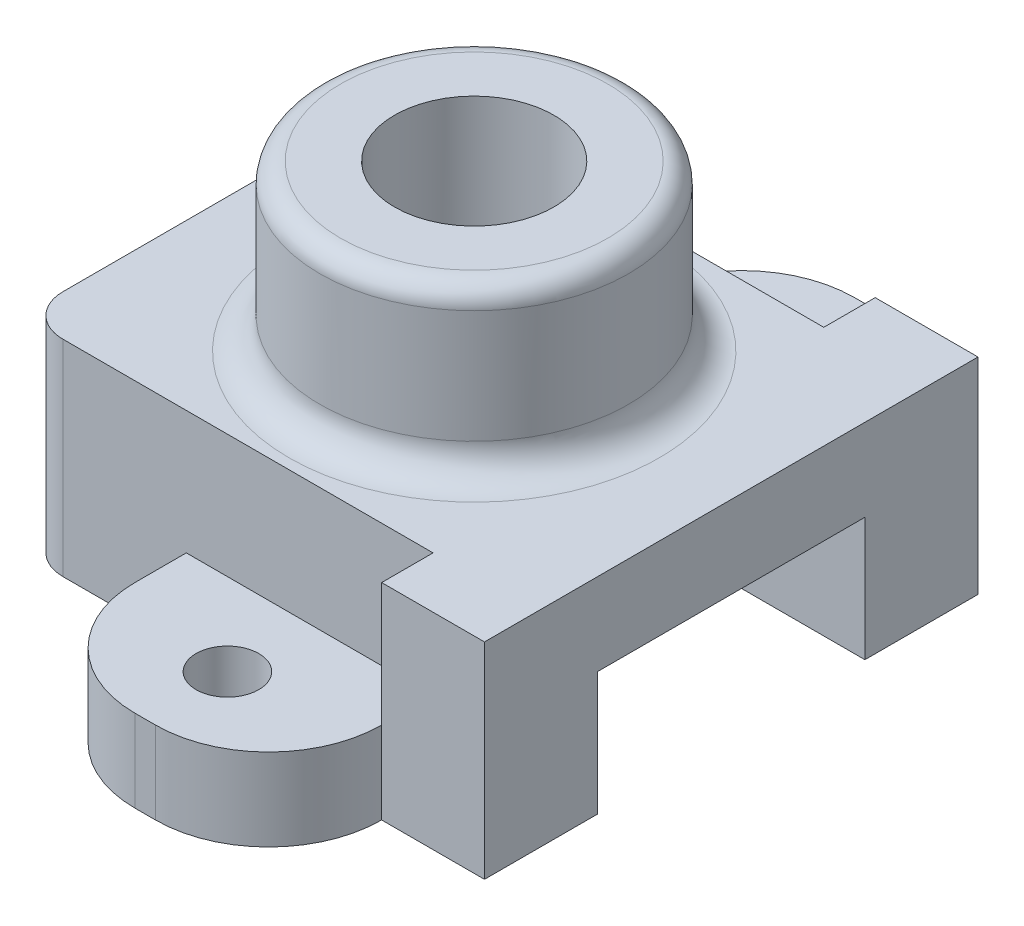
ISO-10303-21;
HEADER;
FILE_DESCRIPTION(('STEP AP214'),'2;1');
FILE_NAME('part.step','',(''),(''),'','','');
FILE_SCHEMA(('AUTOMOTIVE_DESIGN { 1 0 10303 214 1 1 1 1 }'));
ENDSEC;
DATA;
#1=APPLICATION_CONTEXT('core data for automotive mechanical design processes');
#2=APPLICATION_PROTOCOL_DEFINITION('international standard','automotive_design',2000,#1);
#3=PRODUCT_CONTEXT('',#1,'mechanical');
#4=PRODUCT('Part','Part','',(#3));
#5=PRODUCT_RELATED_PRODUCT_CATEGORY('part','',(#4));
#6=PRODUCT_DEFINITION_FORMATION('','',#4);
#7=PRODUCT_DEFINITION_CONTEXT('part definition',#1,'design');
#8=PRODUCT_DEFINITION('design','',#6,#7);
#9=PRODUCT_DEFINITION_SHAPE('','',#8);
#10=(LENGTH_UNIT() NAMED_UNIT(*) SI_UNIT(.MILLI.,.METRE.));
#11=(NAMED_UNIT(*) PLANE_ANGLE_UNIT() SI_UNIT($,.RADIAN.));
#12=(NAMED_UNIT(*) SI_UNIT($,.STERADIAN.) SOLID_ANGLE_UNIT());
#13=UNCERTAINTY_MEASURE_WITH_UNIT(LENGTH_MEASURE(1.E-05),#10,'distance_accuracy_value','');
#14=(GEOMETRIC_REPRESENTATION_CONTEXT(3) GLOBAL_UNCERTAINTY_ASSIGNED_CONTEXT((#13)) GLOBAL_UNIT_ASSIGNED_CONTEXT((#10,
#11,#12)) REPRESENTATION_CONTEXT('',''));
#15=CARTESIAN_POINT('',(0.,0.,0.));
#16=DIRECTION('',(0.,0.,1.));
#17=DIRECTION('',(1.,0.,0.));
#18=AXIS2_PLACEMENT_3D('',#15,#16,#17);
#19=CARTESIAN_POINT('',(-0.999999999999986,6.,-16.));
#20=DIRECTION('',(0.,0.,1.));
#21=DIRECTION('',(1.,0.,0.));
#22=AXIS2_PLACEMENT_3D('',#19,#20,#21);
#23=PLANE('',#22);
#24=DIRECTION('',(0.,-1.,0.));
#25=VECTOR('',#24,1.);
#26=CARTESIAN_POINT('',(-0.999999999999986,6.,-16.));
#27=LINE('',#26,#25);
#28=CARTESIAN_POINT('',(-0.999999999999987,10.,-16.));
#29=VERTEX_POINT('',#28);
#30=CARTESIAN_POINT('',(-0.999999999999986,0.,-16.));
#31=VERTEX_POINT('',#30);
#32=EDGE_CURVE('E449',#29,#31,#27,.T.);
#33=ORIENTED_EDGE('',*,*,#32,.F.);
#34=DIRECTION('',(-1.,0.,0.));
#35=VECTOR('',#34,1.);
#36=CARTESIAN_POINT('',(-0.999999999999987,10.,-16.));
#37=LINE('',#36,#35);
#38=CARTESIAN_POINT('',(17.,10.,-16.));
#39=VERTEX_POINT('',#38);
#40=EDGE_CURVE('E267',#39,#29,#37,.T.);
#41=ORIENTED_EDGE('',*,*,#40,.F.);
#42=DIRECTION('',(0.,1.,0.));
#43=VECTOR('',#42,1.);
#44=CARTESIAN_POINT('',(17.,-5.59016994374948,-16.));
#45=LINE('',#44,#43);
#46=CARTESIAN_POINT('',(17.,4.,-16.));
#47=VERTEX_POINT('',#46);
#48=EDGE_CURVE('E285',#47,#39,#45,.T.);
#49=ORIENTED_EDGE('',*,*,#48,.F.);
#50=DIRECTION('',(1.,0.,0.));
#51=VECTOR('',#50,1.);
#52=CARTESIAN_POINT('',(17.,4.,-16.));
#53=LINE('',#52,#51);
#54=CARTESIAN_POINT('',(5.,4.,-16.));
#55=VERTEX_POINT('',#54);
#56=EDGE_CURVE('E314',#55,#47,#53,.T.);
#57=ORIENTED_EDGE('',*,*,#56,.F.);
#58=DIRECTION('',(0.,-1.,0.));
#59=VECTOR('',#58,1.);
#60=CARTESIAN_POINT('',(5.,22.422205101856,-16.));
#61=LINE('',#60,#59);
#62=CARTESIAN_POINT('',(5.,0.,-16.));
#63=VERTEX_POINT('',#62);
#64=EDGE_CURVE('E362',#55,#63,#61,.T.);
#65=ORIENTED_EDGE('',*,*,#64,.T.);
#66=DIRECTION('',(-1.,0.,0.));
#67=VECTOR('',#66,1.);
#68=CARTESIAN_POINT('',(-0.999999999999986,0.,-16.));
#69=LINE('',#68,#67);
#70=EDGE_CURVE('E427',#63,#31,#69,.T.);
#71=ORIENTED_EDGE('',*,*,#70,.T.);
#72=EDGE_LOOP('',(#33,#41,#49,#57,#65,#71));
#73=FACE_BOUND('',#72,.T.);
#74=ADVANCED_FACE('F33',(#73),#23,.F.);
#75=CARTESIAN_POINT('',(5.,22.422205101856,3.));
#76=DIRECTION('',(-1.,0.,0.));
#77=DIRECTION('',(0.,0.,1.));
#78=AXIS2_PLACEMENT_3D('',#75,#76,#77);
#79=PLANE('',#78);
#80=DIRECTION('',(0.,-1.,0.));
#81=VECTOR('',#80,1.);
#82=CARTESIAN_POINT('',(5.,22.422205101856,5.5));
#83=LINE('',#82,#81);
#84=CARTESIAN_POINT('',(5.,4.,5.5));
#85=VERTEX_POINT('',#84);
#86=CARTESIAN_POINT('',(5.,0.,5.5));
#87=VERTEX_POINT('',#86);
#88=EDGE_CURVE('E386',#85,#87,#83,.T.);
#89=ORIENTED_EDGE('',*,*,#88,.F.);
#90=DIRECTION('',(0.,0.,-1.));
#91=VECTOR('',#90,1.);
#92=CARTESIAN_POINT('',(5.,4.,3.));
#93=LINE('',#92,#91);
#94=CARTESIAN_POINT('',(5.,4.,3.));
#95=VERTEX_POINT('',#94);
#96=EDGE_CURVE('E306',#85,#95,#93,.T.);
#97=ORIENTED_EDGE('',*,*,#96,.T.);
#98=DIRECTION('',(0.,-1.,0.));
#99=VECTOR('',#98,1.);
#100=CARTESIAN_POINT('',(5.,22.422205101856,3.));
#101=LINE('',#100,#99);
#102=CARTESIAN_POINT('',(5.,0.,3.));
#103=VERTEX_POINT('',#102);
#104=EDGE_CURVE('E385',#95,#103,#101,.T.);
#105=ORIENTED_EDGE('',*,*,#104,.T.);
#106=DIRECTION('',(0.,0.,-1.));
#107=VECTOR('',#106,1.);
#108=CARTESIAN_POINT('',(5.,0.,3.));
#109=LINE('',#108,#107);
#110=EDGE_CURVE('E366',#87,#103,#109,.T.);
#111=ORIENTED_EDGE('',*,*,#110,.F.);
#112=EDGE_LOOP('',(#89,#97,#105,#111));
#113=FACE_BOUND('',#112,.T.);
#114=ADVANCED_FACE('F494',(#113),#79,.T.);
#115=CARTESIAN_POINT('',(10.5,22.422205101856,5.5));
#116=DIRECTION('',(0.,-1.,0.));
#117=DIRECTION('',(0.,0.,-1.));
#118=AXIS2_PLACEMENT_3D('',#115,#116,#117);
#119=CYLINDRICAL_SURFACE('',#118,5.5);
#120=DIRECTION('',(0.,-1.,0.));
#121=VECTOR('',#120,1.);
#122=CARTESIAN_POINT('',(10.5,22.422205101856,11.));
#123=LINE('',#122,#121);
#124=CARTESIAN_POINT('',(10.5,4.,11.));
#125=VERTEX_POINT('',#124);
#126=CARTESIAN_POINT('',(10.5,0.,11.));
#127=VERTEX_POINT('',#126);
#128=EDGE_CURVE('E389',#125,#127,#123,.T.);
#129=ORIENTED_EDGE('',*,*,#128,.F.);
#130=CARTESIAN_POINT('',(10.5,4.,5.5));
#131=DIRECTION('',(0.,1.,0.));
#132=DIRECTION('',(0.,0.,1.));
#133=AXIS2_PLACEMENT_3D('',#130,#131,#132);
#134=CIRCLE('',#133,5.5);
#135=EDGE_CURVE('E303',#125,#85,#134,.F.);
#136=ORIENTED_EDGE('',*,*,#135,.T.);
#137=ORIENTED_EDGE('',*,*,#88,.T.);
#138=CARTESIAN_POINT('',(10.5,0.,5.5));
#139=DIRECTION('',(0.,-1.,0.));
#140=DIRECTION('',(0.,0.,1.));
#141=AXIS2_PLACEMENT_3D('',#138,#139,#140);
#142=CIRCLE('',#141,5.5);
#143=EDGE_CURVE('E382',#127,#87,#142,.T.);
#144=ORIENTED_EDGE('',*,*,#143,.F.);
#145=EDGE_LOOP('',(#129,#136,#137,#144));
#146=FACE_BOUND('',#145,.T.);
#147=ADVANCED_FACE('F502',(#146),#119,.T.);
#148=CARTESIAN_POINT('',(10.5,22.422205101856,11.));
#149=DIRECTION('',(0.,0.,1.));
#150=DIRECTION('',(1.,0.,0.));
#151=AXIS2_PLACEMENT_3D('',#148,#149,#150);
#152=PLANE('',#151);
#153=DIRECTION('',(0.,-1.,0.));
#154=VECTOR('',#153,1.);
#155=CARTESIAN_POINT('',(11.5,22.422205101856,11.));
#156=LINE('',#155,#154);
#157=CARTESIAN_POINT('',(11.5,4.,11.));
#158=VERTEX_POINT('',#157);
#159=CARTESIAN_POINT('',(11.5,0.,11.));
#160=VERTEX_POINT('',#159);
#161=EDGE_CURVE('E391',#158,#160,#156,.T.);
#162=ORIENTED_EDGE('',*,*,#161,.F.);
#163=DIRECTION('',(-1.,0.,0.));
#164=VECTOR('',#163,1.);
#165=CARTESIAN_POINT('',(10.5,4.,11.));
#166=LINE('',#165,#164);
#167=EDGE_CURVE('E300',#158,#125,#166,.T.);
#168=ORIENTED_EDGE('',*,*,#167,.T.);
#169=ORIENTED_EDGE('',*,*,#128,.T.);
#170=DIRECTION('',(-1.,0.,0.));
#171=VECTOR('',#170,1.);
#172=CARTESIAN_POINT('',(10.5,0.,11.));
#173=LINE('',#172,#171);
#174=EDGE_CURVE('E379',#160,#127,#173,.T.);
#175=ORIENTED_EDGE('',*,*,#174,.F.);
#176=EDGE_LOOP('',(#162,#168,#169,#175));
#177=FACE_BOUND('',#176,.T.);
#178=ADVANCED_FACE('F646',(#177),#152,.T.);
#179=CARTESIAN_POINT('',(11.5,22.422205101856,5.5));
#180=DIRECTION('',(0.,-1.,0.));
#181=DIRECTION('',(0.,0.,-1.));
#182=AXIS2_PLACEMENT_3D('',#179,#180,#181);
#183=CYLINDRICAL_SURFACE('',#182,5.5);
#184=DIRECTION('',(0.,-1.,0.));
#185=VECTOR('',#184,1.);
#186=CARTESIAN_POINT('',(17.,22.422205101856,5.5));
#187=LINE('',#186,#185);
#188=CARTESIAN_POINT('',(17.,4.,5.5));
#189=VERTEX_POINT('',#188);
#190=CARTESIAN_POINT('',(17.,0.,5.5));
#191=VERTEX_POINT('',#190);
#192=EDGE_CURVE('E393',#189,#191,#187,.T.);
#193=ORIENTED_EDGE('',*,*,#192,.F.);
#194=CARTESIAN_POINT('',(11.5,4.,5.5));
#195=DIRECTION('',(0.,1.,0.));
#196=DIRECTION('',(0.,0.,1.));
#197=AXIS2_PLACEMENT_3D('',#194,#195,#196);
#198=CIRCLE('',#197,5.5);
#199=EDGE_CURVE('E297',#189,#158,#198,.F.);
#200=ORIENTED_EDGE('',*,*,#199,.T.);
#201=ORIENTED_EDGE('',*,*,#161,.T.);
#202=CARTESIAN_POINT('',(11.5,0.,5.5));
#203=DIRECTION('',(0.,-1.,0.));
#204=DIRECTION('',(0.,0.,1.));
#205=AXIS2_PLACEMENT_3D('',#202,#203,#204);
#206=CIRCLE('',#205,5.5);
#207=EDGE_CURVE('E376',#191,#160,#206,.T.);
#208=ORIENTED_EDGE('',*,*,#207,.F.);
#209=EDGE_LOOP('',(#193,#200,#201,#208));
#210=FACE_BOUND('',#209,.T.);
#211=ADVANCED_FACE('F559',(#210),#183,.T.);
#212=CARTESIAN_POINT('',(11.,8.,7.));
#213=DIRECTION('',(0.,-1.,0.));
#214=DIRECTION('',(0.,0.,-1.));
#215=AXIS2_PLACEMENT_3D('',#212,#213,#214);
#216=CYLINDRICAL_SURFACE('',#215,1.524);
#217=CARTESIAN_POINT('',(11.,0.,7.));
#218=DIRECTION('',(0.,-1.,0.));
#219=DIRECTION('',(0.,0.,-1.));
#220=AXIS2_PLACEMENT_3D('',#217,#218,#219);
#221=CIRCLE('',#220,1.524);
#222=CARTESIAN_POINT('',(11.,0.,5.476));
#223=VERTEX_POINT('',#222);
#224=EDGE_CURVE('E344',#223,#223,#221,.T.);
#225=ORIENTED_EDGE('',*,*,#224,.T.);
#226=EDGE_LOOP('',(#225));
#227=FACE_BOUND('',#226,.T.);
#228=CARTESIAN_POINT('',(11.,4.,7.));
#229=DIRECTION('',(0.,1.,0.));
#230=DIRECTION('',(0.,0.,1.));
#231=AXIS2_PLACEMENT_3D('',#228,#229,#230);
#232=CIRCLE('',#231,1.524);
#233=CARTESIAN_POINT('',(11.,4.,8.524));
#234=VERTEX_POINT('',#233);
#235=EDGE_CURVE('E295',#234,#234,#232,.F.);
#236=ORIENTED_EDGE('',*,*,#235,.F.);
#237=EDGE_LOOP('',(#236));
#238=FACE_BOUND('',#237,.T.);
#239=ADVANCED_FACE('F624',(#227,#238),#216,.F.);
#240=CARTESIAN_POINT('',(11.5,22.422205101856,-18.5));
#241=DIRECTION('',(0.,-1.,0.));
#242=DIRECTION('',(0.,0.,-1.));
#243=AXIS2_PLACEMENT_3D('',#240,#241,#242);
#244=CYLINDRICAL_SURFACE('',#243,5.5);
#245=DIRECTION('',(0.,-1.,0.));
#246=VECTOR('',#245,1.);
#247=CARTESIAN_POINT('',(11.5,22.422205101856,-24.));
#248=LINE('',#247,#246);
#249=CARTESIAN_POINT('',(11.5,4.,-24.));
#250=VERTEX_POINT('',#249);
#251=CARTESIAN_POINT('',(11.5,0.,-24.));
#252=VERTEX_POINT('',#251);
#253=EDGE_CURVE('E367',#250,#252,#248,.T.);
#254=ORIENTED_EDGE('',*,*,#253,.F.);
#255=CARTESIAN_POINT('',(11.5,4.,-18.5));
#256=DIRECTION('',(0.,1.,0.));
#257=DIRECTION('',(0.,0.,1.));
#258=AXIS2_PLACEMENT_3D('',#255,#256,#257);
#259=CIRCLE('',#258,5.5);
#260=CARTESIAN_POINT('',(17.,4.,-18.5));
#261=VERTEX_POINT('',#260);
#262=EDGE_CURVE('E322',#250,#261,#259,.F.);
#263=ORIENTED_EDGE('',*,*,#262,.T.);
#264=DIRECTION('',(0.,-1.,0.));
#265=VECTOR('',#264,1.);
#266=CARTESIAN_POINT('',(17.,22.422205101856,-18.5));
#267=LINE('',#266,#265);
#268=CARTESIAN_POINT('',(17.,0.,-18.5));
#269=VERTEX_POINT('',#268);
#270=EDGE_CURVE('E363',#261,#269,#267,.T.);
#271=ORIENTED_EDGE('',*,*,#270,.T.);
#272=CARTESIAN_POINT('',(11.5,0.,-18.5));
#273=DIRECTION('',(0.,-1.,0.));
#274=DIRECTION('',(0.,0.,1.));
#275=AXIS2_PLACEMENT_3D('',#272,#273,#274);
#276=CIRCLE('',#275,5.5);
#277=EDGE_CURVE('E359',#252,#269,#276,.T.);
#278=ORIENTED_EDGE('',*,*,#277,.F.);
#279=EDGE_LOOP('',(#254,#263,#271,#278));
#280=FACE_BOUND('',#279,.T.);
#281=ADVANCED_FACE('F627',(#280),#244,.T.);
#282=CARTESIAN_POINT('',(11.5,22.422205101856,-24.));
#283=DIRECTION('',(0.,0.,-1.));
#284=DIRECTION('',(-1.,0.,0.));
#285=AXIS2_PLACEMENT_3D('',#282,#283,#284);
#286=PLANE('',#285);
#287=DIRECTION('',(0.,-1.,0.));
#288=VECTOR('',#287,1.);
#289=CARTESIAN_POINT('',(10.5,22.422205101856,-24.));
#290=LINE('',#289,#288);
#291=CARTESIAN_POINT('',(10.5,4.,-24.));
#292=VERTEX_POINT('',#291);
#293=CARTESIAN_POINT('',(10.5,0.,-24.));
#294=VERTEX_POINT('',#293);
#295=EDGE_CURVE('E369',#292,#294,#290,.T.);
#296=ORIENTED_EDGE('',*,*,#295,.F.);
#297=DIRECTION('',(1.,0.,0.));
#298=VECTOR('',#297,1.);
#299=CARTESIAN_POINT('',(11.5,4.,-24.));
#300=LINE('',#299,#298);
#301=EDGE_CURVE('E319',#292,#250,#300,.T.);
#302=ORIENTED_EDGE('',*,*,#301,.T.);
#303=ORIENTED_EDGE('',*,*,#253,.T.);
#304=DIRECTION('',(1.,0.,0.));
#305=VECTOR('',#304,1.);
#306=CARTESIAN_POINT('',(11.5,0.,-24.));
#307=LINE('',#306,#305);
#308=EDGE_CURVE('E356',#294,#252,#307,.T.);
#309=ORIENTED_EDGE('',*,*,#308,.F.);
#310=EDGE_LOOP('',(#296,#302,#303,#309));
#311=FACE_BOUND('',#310,.T.);
#312=ADVANCED_FACE('F635',(#311),#286,.T.);
#313=CARTESIAN_POINT('',(10.5,22.422205101856,-18.5));
#314=DIRECTION('',(0.,-1.,0.));
#315=DIRECTION('',(0.,0.,-1.));
#316=AXIS2_PLACEMENT_3D('',#313,#314,#315);
#317=CYLINDRICAL_SURFACE('',#316,5.5);
#318=DIRECTION('',(0.,-1.,0.));
#319=VECTOR('',#318,1.);
#320=CARTESIAN_POINT('',(5.,22.422205101856,-18.5));
#321=LINE('',#320,#319);
#322=CARTESIAN_POINT('',(5.,4.,-18.5));
#323=VERTEX_POINT('',#322);
#324=CARTESIAN_POINT('',(5.,0.,-18.5));
#325=VERTEX_POINT('',#324);
#326=EDGE_CURVE('E371',#323,#325,#321,.T.);
#327=ORIENTED_EDGE('',*,*,#326,.F.);
#328=CARTESIAN_POINT('',(10.5,4.,-18.5));
#329=DIRECTION('',(0.,1.,0.));
#330=DIRECTION('',(0.,0.,1.));
#331=AXIS2_PLACEMENT_3D('',#328,#329,#330);
#332=CIRCLE('',#331,5.5);
#333=EDGE_CURVE('E48',#323,#292,#332,.F.);
#334=ORIENTED_EDGE('',*,*,#333,.T.);
#335=ORIENTED_EDGE('',*,*,#295,.T.);
#336=CARTESIAN_POINT('',(10.5,0.,-18.5));
#337=DIRECTION('',(0.,-1.,0.));
#338=DIRECTION('',(0.,0.,1.));
#339=AXIS2_PLACEMENT_3D('',#336,#337,#338);
#340=CIRCLE('',#339,5.5);
#341=EDGE_CURVE('E353',#325,#294,#340,.T.);
#342=ORIENTED_EDGE('',*,*,#341,.F.);
#343=EDGE_LOOP('',(#327,#334,#335,#342));
#344=FACE_BOUND('',#343,.T.);
#345=ADVANCED_FACE('F604',(#344),#317,.T.);
#346=CARTESIAN_POINT('',(5.,22.422205101856,-16.));
#347=DIRECTION('',(-1.,0.,0.));
#348=DIRECTION('',(0.,0.,1.));
#349=AXIS2_PLACEMENT_3D('',#346,#347,#348);
#350=PLANE('',#349);
#351=ORIENTED_EDGE('',*,*,#64,.F.);
#352=DIRECTION('',(0.,0.,1.));
#353=VECTOR('',#352,1.);
#354=CARTESIAN_POINT('',(5.,4.,-16.));
#355=LINE('',#354,#353);
#356=EDGE_CURVE('E312',#323,#55,#355,.T.);
#357=ORIENTED_EDGE('',*,*,#356,.F.);
#358=ORIENTED_EDGE('',*,*,#326,.T.);
#359=DIRECTION('',(0.,0.,-1.));
#360=VECTOR('',#359,1.);
#361=CARTESIAN_POINT('',(5.,0.,-16.));
#362=LINE('',#361,#360);
#363=EDGE_CURVE('E350',#63,#325,#362,.T.);
#364=ORIENTED_EDGE('',*,*,#363,.F.);
#365=EDGE_LOOP('',(#351,#357,#358,#364));
#366=FACE_BOUND('',#365,.T.);
#367=ADVANCED_FACE('F600',(#366),#350,.T.);
#368=CARTESIAN_POINT('',(11.,8.,-20.));
#369=DIRECTION('',(0.,-1.,0.));
#370=DIRECTION('',(0.,0.,-1.));
#371=AXIS2_PLACEMENT_3D('',#368,#369,#370);
#372=CYLINDRICAL_SURFACE('',#371,1.525);
#373=CARTESIAN_POINT('',(11.,0.,-20.));
#374=DIRECTION('',(0.,-1.,0.));
#375=DIRECTION('',(0.,0.,-1.));
#376=AXIS2_PLACEMENT_3D('',#373,#374,#375);
#377=CIRCLE('',#376,1.525);
#378=CARTESIAN_POINT('',(11.,0.,-21.525));
#379=VERTEX_POINT('',#378);
#380=EDGE_CURVE('E347',#379,#379,#377,.T.);
#381=ORIENTED_EDGE('',*,*,#380,.T.);
#382=EDGE_LOOP('',(#381));
#383=FACE_BOUND('',#382,.T.);
#384=CARTESIAN_POINT('',(11.,4.,-20.));
#385=DIRECTION('',(0.,1.,0.));
#386=DIRECTION('',(0.,0.,1.));
#387=AXIS2_PLACEMENT_3D('',#384,#385,#386);
#388=CIRCLE('',#387,1.525);
#389=CARTESIAN_POINT('',(11.,4.,-18.475));
#390=VERTEX_POINT('',#389);
#391=EDGE_CURVE('E317',#390,#390,#388,.F.);
#392=ORIENTED_EDGE('',*,*,#391,.F.);
#393=EDGE_LOOP('',(#392));
#394=FACE_BOUND('',#393,.T.);
#395=ADVANCED_FACE('F629',(#383,#394),#372,.F.);
#396=CARTESIAN_POINT('',(-1.,0.,1.));
#397=DIRECTION('',(0.,-1.,0.));
#398=DIRECTION('',(0.,0.,-1.));
#399=AXIS2_PLACEMENT_3D('',#396,#397,#398);
#400=PLANE('',#399);
#401=DIRECTION('',(-1.,0.,0.));
#402=VECTOR('',#401,1.);
#403=CARTESIAN_POINT('',(17.,0.,-18.5));
#404=LINE('',#403,#402);
#405=CARTESIAN_POINT('',(22.,0.,-18.5));
#406=VERTEX_POINT('',#405);
#407=EDGE_CURVE('E235',#406,#269,#404,.T.);
#408=ORIENTED_EDGE('',*,*,#407,.F.);
#409=DIRECTION('',(0.,0.,-1.));
#410=VECTOR('',#409,1.);
#411=CARTESIAN_POINT('',(22.,0.,-18.5));
#412=LINE('',#411,#410);
#413=CARTESIAN_POINT('',(22.,0.,-13.));
#414=VERTEX_POINT('',#413);
#415=EDGE_CURVE('E287',#414,#406,#412,.T.);
#416=ORIENTED_EDGE('',*,*,#415,.F.);
#417=DIRECTION('',(-1.,0.,0.));
#418=VECTOR('',#417,1.);
#419=CARTESIAN_POINT('',(0.,0.,-13.));
#420=LINE('',#419,#418);
#421=CARTESIAN_POINT('',(0.,0.,-13.));
#422=VERTEX_POINT('',#421);
#423=EDGE_CURVE('E400',#414,#422,#420,.T.);
#424=ORIENTED_EDGE('',*,*,#423,.T.);
#425=DIRECTION('',(0.,0.,1.));
#426=VECTOR('',#425,1.);
#427=CARTESIAN_POINT('',(0.,0.,0.));
#428=LINE('',#427,#426);
#429=CARTESIAN_POINT('',(0.,0.,-11.));
#430=VERTEX_POINT('',#429);
#431=EDGE_CURVE('E409',#422,#430,#428,.T.);
#432=ORIENTED_EDGE('',*,*,#431,.T.);
#433=DIRECTION('',(1.,0.,0.));
#434=VECTOR('',#433,1.);
#435=CARTESIAN_POINT('',(-3.,0.,-11.));
#436=LINE('',#435,#434);
#437=CARTESIAN_POINT('',(-3.,0.,-11.));
#438=VERTEX_POINT('',#437);
#439=EDGE_CURVE('E333',#438,#430,#436,.T.);
#440=ORIENTED_EDGE('',*,*,#439,.F.);
#441=DIRECTION('',(0.,0.,1.));
#442=VECTOR('',#441,1.);
#443=CARTESIAN_POINT('',(-3.,0.,0.999999999999986));
#444=LINE('',#443,#442);
#445=CARTESIAN_POINT('',(-3.,0.,-14.));
#446=VERTEX_POINT('',#445);
#447=EDGE_CURVE('E432',#446,#438,#444,.T.);
#448=ORIENTED_EDGE('',*,*,#447,.F.);
#449=CARTESIAN_POINT('',(-1.,0.,-14.));
#450=DIRECTION('',(0.,1.,0.));
#451=DIRECTION('',(0.,0.,1.));
#452=AXIS2_PLACEMENT_3D('',#449,#450,#451);
#453=CIRCLE('',#452,2.);
#454=EDGE_CURVE('E429',#31,#446,#453,.T.);
#455=ORIENTED_EDGE('',*,*,#454,.F.);
#456=ORIENTED_EDGE('',*,*,#70,.F.);
#457=ORIENTED_EDGE('',*,*,#363,.T.);
#458=ORIENTED_EDGE('',*,*,#341,.T.);
#459=ORIENTED_EDGE('',*,*,#308,.T.);
#460=ORIENTED_EDGE('',*,*,#277,.T.);
#461=EDGE_LOOP('',(#408,#416,#424,#432,#440,#448,#455,#456,#457,#458,#459,#460));
#462=FACE_BOUND('',#461,.T.);
#463=ORIENTED_EDGE('',*,*,#380,.F.);
#464=EDGE_LOOP('',(#463));
#465=FACE_BOUND('',#464,.T.);
#466=ADVANCED_FACE('F582',(#462,#465),#400,.T.);
#467=DIRECTION('',(1.,0.,0.));
#468=VECTOR('',#467,1.);
#469=CARTESIAN_POINT('',(0.,0.,0.));
#470=LINE('',#469,#468);
#471=CARTESIAN_POINT('',(0.,0.,0.));
#472=VERTEX_POINT('',#471);
#473=CARTESIAN_POINT('',(22.,0.,0.));
#474=VERTEX_POINT('',#473);
#475=EDGE_CURVE('E412',#472,#474,#470,.T.);
#476=ORIENTED_EDGE('',*,*,#475,.T.);
#477=CARTESIAN_POINT('',(22.,0.,5.5));
#478=VERTEX_POINT('',#477);
#479=EDGE_CURVE('E288',#478,#474,#412,.T.);
#480=ORIENTED_EDGE('',*,*,#479,.F.);
#481=DIRECTION('',(1.,0.,0.));
#482=VECTOR('',#481,1.);
#483=CARTESIAN_POINT('',(17.,0.,5.5));
#484=LINE('',#483,#482);
#485=EDGE_CURVE('E279',#191,#478,#484,.T.);
#486=ORIENTED_EDGE('',*,*,#485,.F.);
#487=ORIENTED_EDGE('',*,*,#207,.T.);
#488=ORIENTED_EDGE('',*,*,#174,.T.);
#489=ORIENTED_EDGE('',*,*,#143,.T.);
#490=ORIENTED_EDGE('',*,*,#110,.T.);
#491=DIRECTION('',(1.,0.,0.));
#492=VECTOR('',#491,1.);
#493=CARTESIAN_POINT('',(-0.999999999999987,0.,3.));
#494=LINE('',#493,#492);
#495=CARTESIAN_POINT('',(-0.999999999999987,0.,3.));
#496=VERTEX_POINT('',#495);
#497=EDGE_CURVE('E437',#496,#103,#494,.T.);
#498=ORIENTED_EDGE('',*,*,#497,.F.);
#499=CARTESIAN_POINT('',(-1.,0.,1.));
#500=DIRECTION('',(0.,1.,0.));
#501=DIRECTION('',(0.,0.,-1.));
#502=AXIS2_PLACEMENT_3D('',#499,#500,#501);
#503=CIRCLE('',#502,2.);
#504=CARTESIAN_POINT('',(-3.,0.,0.999999999999987));
#505=VERTEX_POINT('',#504);
#506=EDGE_CURVE('E435',#505,#496,#503,.T.);
#507=ORIENTED_EDGE('',*,*,#506,.F.);
#508=CARTESIAN_POINT('',(-3.,0.,-2.));
#509=VERTEX_POINT('',#508);
#510=EDGE_CURVE('E431',#509,#505,#444,.T.);
#511=ORIENTED_EDGE('',*,*,#510,.F.);
#512=DIRECTION('',(1.,0.,0.));
#513=VECTOR('',#512,1.);
#514=CARTESIAN_POINT('',(-3.,0.,-2.));
#515=LINE('',#514,#513);
#516=CARTESIAN_POINT('',(0.,0.,-2.));
#517=VERTEX_POINT('',#516);
#518=EDGE_CURVE('E332',#509,#517,#515,.T.);
#519=ORIENTED_EDGE('',*,*,#518,.T.);
#520=EDGE_CURVE('E388',#517,#472,#428,.T.);
#521=ORIENTED_EDGE('',*,*,#520,.T.);
#522=EDGE_LOOP('',(#476,#480,#486,#487,#488,#489,#490,#498,#507,#511,#519,#521));
#523=FACE_BOUND('',#522,.T.);
#524=ORIENTED_EDGE('',*,*,#224,.F.);
#525=EDGE_LOOP('',(#524));
#526=FACE_BOUND('',#525,.T.);
#527=ADVANCED_FACE('F542',(#523,#526),#400,.T.);
#528=CARTESIAN_POINT('',(-1.,6.,-14.));
#529=DIRECTION('',(0.,-1.,0.));
#530=DIRECTION('',(0.,0.,-1.));
#531=AXIS2_PLACEMENT_3D('',#528,#529,#530);
#532=CYLINDRICAL_SURFACE('',#531,2.);
#533=ORIENTED_EDGE('',*,*,#454,.T.);
#534=DIRECTION('',(0.,-1.,0.));
#535=VECTOR('',#534,1.);
#536=CARTESIAN_POINT('',(-3.,6.,-14.));
#537=LINE('',#536,#535);
#538=CARTESIAN_POINT('',(-3.,10.,-14.));
#539=VERTEX_POINT('',#538);
#540=EDGE_CURVE('E446',#539,#446,#537,.T.);
#541=ORIENTED_EDGE('',*,*,#540,.F.);
#542=CARTESIAN_POINT('',(-0.999999999999987,10.,-14.));
#543=DIRECTION('',(0.,1.,0.));
#544=DIRECTION('',(0.,0.,-1.));
#545=AXIS2_PLACEMENT_3D('',#542,#543,#544);
#546=CIRCLE('',#545,2.00000000000001);
#547=EDGE_CURVE('E270',#29,#539,#546,.T.);
#548=ORIENTED_EDGE('',*,*,#547,.F.);
#549=ORIENTED_EDGE('',*,*,#32,.T.);
#550=EDGE_LOOP('',(#533,#541,#548,#549));
#551=FACE_BOUND('',#550,.T.);
#552=ADVANCED_FACE('F507',(#551),#532,.T.);
#553=CARTESIAN_POINT('',(-3.,6.,0.999999999999986));
#554=DIRECTION('',(1.,0.,0.));
#555=DIRECTION('',(0.,0.,-1.));
#556=AXIS2_PLACEMENT_3D('',#553,#554,#555);
#557=PLANE('',#556);
#558=ORIENTED_EDGE('',*,*,#447,.T.);
#559=DIRECTION('',(0.,1.,0.));
#560=VECTOR('',#559,1.);
#561=CARTESIAN_POINT('',(-3.,0.,-11.));
#562=LINE('',#561,#560);
#563=CARTESIAN_POINT('',(-3.,2.0886522564545,-11.));
#564=VERTEX_POINT('',#563);
#565=EDGE_CURVE('E325',#438,#564,#562,.T.);
#566=ORIENTED_EDGE('',*,*,#565,.T.);
#567=CARTESIAN_POINT('',(-3.,2.0886522564545,-9.00000000000001));
#568=DIRECTION('',(1.,0.,0.));
#569=DIRECTION('',(0.,0.,-1.));
#570=AXIS2_PLACEMENT_3D('',#567,#568,#569);
#571=CIRCLE('',#570,2.);
#572=CARTESIAN_POINT('',(-3.,4.0886522564545,-9.00000000000001));
#573=VERTEX_POINT('',#572);
#574=EDGE_CURVE('E467',#564,#573,#571,.T.);
#575=ORIENTED_EDGE('',*,*,#574,.T.);
#576=DIRECTION('',(0.,0.,1.));
#577=VECTOR('',#576,1.);
#578=CARTESIAN_POINT('',(-3.,4.0886522564545,-11.));
#579=LINE('',#578,#577);
#580=CARTESIAN_POINT('',(-3.,4.08865225645449,-4.));
#581=VERTEX_POINT('',#580);
#582=EDGE_CURVE('E327',#573,#581,#579,.T.);
#583=ORIENTED_EDGE('',*,*,#582,.T.);
#584=CARTESIAN_POINT('',(-3.,2.0886522564545,-4.));
#585=DIRECTION('',(1.,0.,0.));
#586=DIRECTION('',(0.,0.,-1.));
#587=AXIS2_PLACEMENT_3D('',#584,#585,#586);
#588=CIRCLE('',#587,2.);
#589=CARTESIAN_POINT('',(-3.,2.08865225645449,-2.));
#590=VERTEX_POINT('',#589);
#591=EDGE_CURVE('E463',#581,#590,#588,.T.);
#592=ORIENTED_EDGE('',*,*,#591,.T.);
#593=DIRECTION('',(0.,-1.,0.));
#594=VECTOR('',#593,1.);
#595=CARTESIAN_POINT('',(-3.,0.,-2.));
#596=LINE('',#595,#594);
#597=EDGE_CURVE('E330',#590,#509,#596,.T.);
#598=ORIENTED_EDGE('',*,*,#597,.T.);
#599=ORIENTED_EDGE('',*,*,#510,.T.);
#600=DIRECTION('',(0.,-1.,0.));
#601=VECTOR('',#600,1.);
#602=CARTESIAN_POINT('',(-3.,6.,0.999999999999987));
#603=LINE('',#602,#601);
#604=CARTESIAN_POINT('',(-3.,10.,0.999999999999986));
#605=VERTEX_POINT('',#604);
#606=EDGE_CURVE('E443',#605,#505,#603,.T.);
#607=ORIENTED_EDGE('',*,*,#606,.F.);
#608=DIRECTION('',(0.,0.,1.));
#609=VECTOR('',#608,1.);
#610=CARTESIAN_POINT('',(-3.,10.,0.999999999999986));
#611=LINE('',#610,#609);
#612=EDGE_CURVE('E273',#539,#605,#611,.T.);
#613=ORIENTED_EDGE('',*,*,#612,.F.);
#614=ORIENTED_EDGE('',*,*,#540,.T.);
#615=EDGE_LOOP('',(#558,#566,#575,#583,#592,#598,#599,#607,#613,#614));
#616=FACE_BOUND('',#615,.T.);
#617=ADVANCED_FACE('F527',(#616),#557,.F.);
#618=CARTESIAN_POINT('',(-1.,6.,1.));
#619=DIRECTION('',(0.,-1.,0.));
#620=DIRECTION('',(0.,0.,-1.));
#621=AXIS2_PLACEMENT_3D('',#618,#619,#620);
#622=CYLINDRICAL_SURFACE('',#621,2.);
#623=ORIENTED_EDGE('',*,*,#506,.T.);
#624=DIRECTION('',(0.,-1.,0.));
#625=VECTOR('',#624,1.);
#626=CARTESIAN_POINT('',(-0.999999999999987,6.,3.));
#627=LINE('',#626,#625);
#628=CARTESIAN_POINT('',(-0.999999999999958,10.,3.));
#629=VERTEX_POINT('',#628);
#630=EDGE_CURVE('E440',#629,#496,#627,.T.);
#631=ORIENTED_EDGE('',*,*,#630,.F.);
#632=CARTESIAN_POINT('',(-0.999999999999958,10.,0.999999999999957));
#633=DIRECTION('',(0.,1.,0.));
#634=DIRECTION('',(0.,0.,-1.));
#635=AXIS2_PLACEMENT_3D('',#632,#633,#634);
#636=CIRCLE('',#635,2.00000000000004);
#637=EDGE_CURVE('E276',#605,#629,#636,.T.);
#638=ORIENTED_EDGE('',*,*,#637,.F.);
#639=ORIENTED_EDGE('',*,*,#606,.T.);
#640=EDGE_LOOP('',(#623,#631,#638,#639));
#641=FACE_BOUND('',#640,.T.);
#642=ADVANCED_FACE('F548',(#641),#622,.T.);
#643=CARTESIAN_POINT('',(-0.999999999999987,6.,3.));
#644=DIRECTION('',(0.,0.,-1.));
#645=DIRECTION('',(-1.,0.,0.));
#646=AXIS2_PLACEMENT_3D('',#643,#644,#645);
#647=PLANE('',#646);
#648=DIRECTION('',(-1.,0.,0.));
#649=VECTOR('',#648,1.);
#650=CARTESIAN_POINT('',(19.0682094438694,4.,3.));
#651=LINE('',#650,#649);
#652=CARTESIAN_POINT('',(17.,4.,3.));
#653=VERTEX_POINT('',#652);
#654=EDGE_CURVE('E293',#653,#95,#651,.T.);
#655=ORIENTED_EDGE('',*,*,#654,.F.);
#656=DIRECTION('',(0.,1.,0.));
#657=VECTOR('',#656,1.);
#658=CARTESIAN_POINT('',(17.,-5.59016994374948,3.));
#659=LINE('',#658,#657);
#660=CARTESIAN_POINT('',(17.,10.,3.));
#661=VERTEX_POINT('',#660);
#662=EDGE_CURVE('E236',#653,#661,#659,.T.);
#663=ORIENTED_EDGE('',*,*,#662,.T.);
#664=DIRECTION('',(1.,0.,0.));
#665=VECTOR('',#664,1.);
#666=CARTESIAN_POINT('',(17.,10.,3.));
#667=LINE('',#666,#665);
#668=EDGE_CURVE('E252',#629,#661,#667,.T.);
#669=ORIENTED_EDGE('',*,*,#668,.F.);
#670=ORIENTED_EDGE('',*,*,#630,.T.);
#671=ORIENTED_EDGE('',*,*,#497,.T.);
#672=ORIENTED_EDGE('',*,*,#104,.F.);
#673=EDGE_LOOP('',(#655,#663,#669,#670,#671,#672));
#674=FACE_BOUND('',#673,.T.);
#675=ADVANCED_FACE('F551',(#674),#647,.F.);
#676=CARTESIAN_POINT('',(0.,6.,0.));
#677=DIRECTION('',(1.,0.,0.));
#678=DIRECTION('',(0.,0.,-1.));
#679=AXIS2_PLACEMENT_3D('',#676,#677,#678);
#680=PLANE('',#679);
#681=DIRECTION('',(0.,1.,0.));
#682=VECTOR('',#681,1.);
#683=CARTESIAN_POINT('',(0.,6.,-11.));
#684=LINE('',#683,#682);
#685=CARTESIAN_POINT('',(0.,2.0886522564545,-11.));
#686=VERTEX_POINT('',#685);
#687=EDGE_CURVE('E342',#430,#686,#684,.T.);
#688=ORIENTED_EDGE('',*,*,#687,.F.);
#689=ORIENTED_EDGE('',*,*,#431,.F.);
#690=DIRECTION('',(0.,-1.,0.));
#691=VECTOR('',#690,1.);
#692=CARTESIAN_POINT('',(0.,6.,-13.));
#693=LINE('',#692,#691);
#694=CARTESIAN_POINT('',(0.,6.,-13.));
#695=VERTEX_POINT('',#694);
#696=EDGE_CURVE('E408',#695,#422,#693,.T.);
#697=ORIENTED_EDGE('',*,*,#696,.F.);
#698=DIRECTION('',(0.,0.,1.));
#699=VECTOR('',#698,1.);
#700=CARTESIAN_POINT('',(0.,6.,0.));
#701=LINE('',#700,#699);
#702=CARTESIAN_POINT('',(0.,6.,0.));
#703=VERTEX_POINT('',#702);
#704=EDGE_CURVE('E396',#695,#703,#701,.T.);
#705=ORIENTED_EDGE('',*,*,#704,.T.);
#706=DIRECTION('',(0.,-1.,0.));
#707=VECTOR('',#706,1.);
#708=CARTESIAN_POINT('',(0.,6.,0.));
#709=LINE('',#708,#707);
#710=EDGE_CURVE('E424',#703,#472,#709,.T.);
#711=ORIENTED_EDGE('',*,*,#710,.T.);
#712=ORIENTED_EDGE('',*,*,#520,.F.);
#713=DIRECTION('',(0.,-1.,0.));
#714=VECTOR('',#713,1.);
#715=CARTESIAN_POINT('',(0.,6.,-2.));
#716=LINE('',#715,#714);
#717=CARTESIAN_POINT('',(0.,2.08865225645449,-2.));
#718=VERTEX_POINT('',#717);
#719=EDGE_CURVE('E340',#718,#517,#716,.T.);
#720=ORIENTED_EDGE('',*,*,#719,.F.);
#721=CARTESIAN_POINT('',(0.,2.0886522564545,-4.));
#722=DIRECTION('',(1.,0.,0.));
#723=DIRECTION('',(0.,0.,-1.));
#724=AXIS2_PLACEMENT_3D('',#721,#722,#723);
#725=CIRCLE('',#724,2.);
#726=CARTESIAN_POINT('',(0.,4.0886522564545,-4.));
#727=VERTEX_POINT('',#726);
#728=EDGE_CURVE('E461',#718,#727,#725,.F.);
#729=ORIENTED_EDGE('',*,*,#728,.T.);
#730=DIRECTION('',(0.,0.,1.));
#731=VECTOR('',#730,1.);
#732=CARTESIAN_POINT('',(0.,4.08865225645449,0.));
#733=LINE('',#732,#731);
#734=CARTESIAN_POINT('',(0.,4.0886522564545,-9.00000000000001));
#735=VERTEX_POINT('',#734);
#736=EDGE_CURVE('E335',#735,#727,#733,.T.);
#737=ORIENTED_EDGE('',*,*,#736,.F.);
#738=CARTESIAN_POINT('',(0.,2.0886522564545,-9.00000000000001));
#739=DIRECTION('',(1.,0.,0.));
#740=DIRECTION('',(0.,0.,-1.));
#741=AXIS2_PLACEMENT_3D('',#738,#739,#740);
#742=CIRCLE('',#741,2.);
#743=EDGE_CURVE('E465',#735,#686,#742,.F.);
#744=ORIENTED_EDGE('',*,*,#743,.T.);
#745=EDGE_LOOP('',(#688,#689,#697,#705,#711,#712,#720,#729,#737,#744));
#746=FACE_BOUND('',#745,.T.);
#747=ADVANCED_FACE('F569',(#746),#680,.T.);
#748=CARTESIAN_POINT('',(0.,6.,0.));
#749=DIRECTION('',(0.,0.,-1.));
#750=DIRECTION('',(-1.,0.,0.));
#751=AXIS2_PLACEMENT_3D('',#748,#749,#750);
#752=PLANE('',#751);
#753=ORIENTED_EDGE('',*,*,#475,.F.);
#754=ORIENTED_EDGE('',*,*,#710,.F.);
#755=DIRECTION('',(1.,0.,0.));
#756=VECTOR('',#755,1.);
#757=CARTESIAN_POINT('',(0.,6.,0.));
#758=LINE('',#757,#756);
#759=CARTESIAN_POINT('',(22.,6.,0.));
#760=VERTEX_POINT('',#759);
#761=EDGE_CURVE('E399',#703,#760,#758,.T.);
#762=ORIENTED_EDGE('',*,*,#761,.T.);
#763=DIRECTION('',(0.,-1.,0.));
#764=VECTOR('',#763,1.);
#765=CARTESIAN_POINT('',(22.,6.,0.));
#766=LINE('',#765,#764);
#767=EDGE_CURVE('E421',#760,#474,#766,.T.);
#768=ORIENTED_EDGE('',*,*,#767,.T.);
#769=EDGE_LOOP('',(#753,#754,#762,#768));
#770=FACE_BOUND('',#769,.T.);
#771=ADVANCED_FACE('F566',(#770),#752,.T.);
#772=CARTESIAN_POINT('',(0.,6.,-13.));
#773=DIRECTION('',(0.,0.,1.));
#774=DIRECTION('',(1.,0.,0.));
#775=AXIS2_PLACEMENT_3D('',#772,#773,#774);
#776=PLANE('',#775);
#777=ORIENTED_EDGE('',*,*,#423,.F.);
#778=DIRECTION('',(0.,-1.,0.));
#779=VECTOR('',#778,1.);
#780=CARTESIAN_POINT('',(22.,6.,-13.));
#781=LINE('',#780,#779);
#782=CARTESIAN_POINT('',(22.,6.,-13.));
#783=VERTEX_POINT('',#782);
#784=EDGE_CURVE('E419',#783,#414,#781,.T.);
#785=ORIENTED_EDGE('',*,*,#784,.F.);
#786=DIRECTION('',(-1.,0.,0.));
#787=VECTOR('',#786,1.);
#788=CARTESIAN_POINT('',(0.,6.,-13.));
#789=LINE('',#788,#787);
#790=EDGE_CURVE('E405',#783,#695,#789,.T.);
#791=ORIENTED_EDGE('',*,*,#790,.T.);
#792=ORIENTED_EDGE('',*,*,#696,.T.);
#793=EDGE_LOOP('',(#777,#785,#791,#792));
#794=FACE_BOUND('',#793,.T.);
#795=ADVANCED_FACE('F578',(#794),#776,.T.);
#796=CARTESIAN_POINT('',(-0.999999999999979,6.,0.999999999999979));
#797=DIRECTION('',(0.,-1.,0.));
#798=DIRECTION('',(0.,0.,-1.));
#799=AXIS2_PLACEMENT_3D('',#796,#797,#798);
#800=PLANE('',#799);
#801=ORIENTED_EDGE('',*,*,#761,.F.);
#802=ORIENTED_EDGE('',*,*,#704,.F.);
#803=ORIENTED_EDGE('',*,*,#790,.F.);
#804=DIRECTION('',(0.,0.,-1.));
#805=VECTOR('',#804,1.);
#806=CARTESIAN_POINT('',(22.,6.,0.));
#807=LINE('',#806,#805);
#808=EDGE_CURVE('E403',#760,#783,#807,.T.);
#809=ORIENTED_EDGE('',*,*,#808,.F.);
#810=EDGE_LOOP('',(#801,#802,#803,#809));
#811=FACE_BOUND('',#810,.T.);
#812=ADVANCED_FACE('F573',(#811),#800,.T.);
#813=CARTESIAN_POINT('',(-3.,0.,-11.));
#814=DIRECTION('',(0.,0.,-1.));
#815=DIRECTION('',(-1.,0.,0.));
#816=AXIS2_PLACEMENT_3D('',#813,#814,#815);
#817=PLANE('',#816);
#818=ORIENTED_EDGE('',*,*,#687,.T.);
#819=DIRECTION('',(1.,0.,0.));
#820=VECTOR('',#819,1.);
#821=CARTESIAN_POINT('',(-3.,2.0886522564545,-11.));
#822=LINE('',#821,#820);
#823=EDGE_CURVE('E56',#686,#564,#822,.F.);
#824=ORIENTED_EDGE('',*,*,#823,.T.);
#825=ORIENTED_EDGE('',*,*,#565,.F.);
#826=ORIENTED_EDGE('',*,*,#439,.T.);
#827=EDGE_LOOP('',(#818,#824,#825,#826));
#828=FACE_BOUND('',#827,.T.);
#829=ADVANCED_FACE('F613',(#828),#817,.F.);
#830=CARTESIAN_POINT('',(-3.,0.,-2.));
#831=DIRECTION('',(0.,0.,1.));
#832=DIRECTION('',(0.,-1.,0.));
#833=AXIS2_PLACEMENT_3D('',#830,#831,#832);
#834=PLANE('',#833);
#835=ORIENTED_EDGE('',*,*,#597,.F.);
#836=DIRECTION('',(1.,0.,0.));
#837=VECTOR('',#836,1.);
#838=CARTESIAN_POINT('',(0.,2.08865225645449,-2.));
#839=LINE('',#838,#837);
#840=EDGE_CURVE('E452',#590,#718,#839,.T.);
#841=ORIENTED_EDGE('',*,*,#840,.T.);
#842=ORIENTED_EDGE('',*,*,#719,.T.);
#843=ORIENTED_EDGE('',*,*,#518,.F.);
#844=EDGE_LOOP('',(#835,#841,#842,#843));
#845=FACE_BOUND('',#844,.T.);
#846=ADVANCED_FACE('F536',(#845),#834,.F.);
#847=CARTESIAN_POINT('',(-3.,4.0886522564545,-11.));
#848=DIRECTION('',(0.,1.,0.));
#849=DIRECTION('',(0.,0.,1.));
#850=AXIS2_PLACEMENT_3D('',#847,#848,#849);
#851=PLANE('',#850);
#852=ORIENTED_EDGE('',*,*,#736,.T.);
#853=DIRECTION('',(1.,0.,0.));
#854=VECTOR('',#853,1.);
#855=CARTESIAN_POINT('',(-3.,4.08865225645449,-4.));
#856=LINE('',#855,#854);
#857=EDGE_CURVE('E458',#727,#581,#856,.F.);
#858=ORIENTED_EDGE('',*,*,#857,.T.);
#859=ORIENTED_EDGE('',*,*,#582,.F.);
#860=DIRECTION('',(1.,0.,0.));
#861=VECTOR('',#860,1.);
#862=CARTESIAN_POINT('',(0.,4.0886522564545,-9.00000000000001));
#863=LINE('',#862,#861);
#864=EDGE_CURVE('E455',#573,#735,#863,.T.);
#865=ORIENTED_EDGE('',*,*,#864,.T.);
#866=EDGE_LOOP('',(#852,#858,#859,#865));
#867=FACE_BOUND('',#866,.T.);
#868=ADVANCED_FACE('F513',(#867),#851,.F.);
#869=CARTESIAN_POINT('',(-3.,2.0886522564545,-4.));
#870=DIRECTION('',(-1.,0.,0.));
#871=DIRECTION('',(0.,0.,1.));
#872=AXIS2_PLACEMENT_3D('',#869,#870,#871);
#873=CYLINDRICAL_SURFACE('',#872,2.);
#874=ORIENTED_EDGE('',*,*,#591,.F.);
#875=ORIENTED_EDGE('',*,*,#857,.F.);
#876=ORIENTED_EDGE('',*,*,#728,.F.);
#877=ORIENTED_EDGE('',*,*,#840,.F.);
#878=EDGE_LOOP('',(#874,#875,#876,#877));
#879=FACE_BOUND('',#878,.T.);
#880=ADVANCED_FACE('F509',(#879),#873,.F.);
#881=CARTESIAN_POINT('',(-3.,2.0886522564545,-9.00000000000001));
#882=DIRECTION('',(-1.,0.,0.));
#883=DIRECTION('',(0.,0.,1.));
#884=AXIS2_PLACEMENT_3D('',#881,#882,#883);
#885=CYLINDRICAL_SURFACE('',#884,2.);
#886=ORIENTED_EDGE('',*,*,#574,.F.);
#887=ORIENTED_EDGE('',*,*,#823,.F.);
#888=ORIENTED_EDGE('',*,*,#743,.F.);
#889=ORIENTED_EDGE('',*,*,#864,.F.);
#890=EDGE_LOOP('',(#886,#887,#888,#889));
#891=FACE_BOUND('',#890,.T.);
#892=ADVANCED_FACE('F512',(#891),#885,.F.);
#893=CARTESIAN_POINT('',(0.,4.,0.));
#894=DIRECTION('',(0.,1.,0.));
#895=DIRECTION('',(0.,0.,1.));
#896=AXIS2_PLACEMENT_3D('',#893,#894,#895);
#897=PLANE('',#896);
#898=ORIENTED_EDGE('',*,*,#301,.F.);
#899=ORIENTED_EDGE('',*,*,#333,.F.);
#900=ORIENTED_EDGE('',*,*,#356,.T.);
#901=ORIENTED_EDGE('',*,*,#56,.T.);
#902=DIRECTION('',(0.,0.,-1.));
#903=VECTOR('',#902,1.);
#904=CARTESIAN_POINT('',(17.,4.,-16.));
#905=LINE('',#904,#903);
#906=EDGE_CURVE('E309',#47,#261,#905,.T.);
#907=ORIENTED_EDGE('',*,*,#906,.T.);
#908=ORIENTED_EDGE('',*,*,#262,.F.);
#909=EDGE_LOOP('',(#898,#899,#900,#901,#907,#908));
#910=FACE_BOUND('',#909,.T.);
#911=ORIENTED_EDGE('',*,*,#391,.T.);
#912=EDGE_LOOP('',(#911));
#913=FACE_BOUND('',#912,.T.);
#914=ADVANCED_FACE('F516',(#910,#913),#897,.T.);
#915=CARTESIAN_POINT('',(0.,4.,0.));
#916=DIRECTION('',(0.,1.,0.));
#917=DIRECTION('',(0.,0.,1.));
#918=AXIS2_PLACEMENT_3D('',#915,#916,#917);
#919=PLANE('',#918);
#920=ORIENTED_EDGE('',*,*,#135,.F.);
#921=ORIENTED_EDGE('',*,*,#167,.F.);
#922=ORIENTED_EDGE('',*,*,#199,.F.);
#923=DIRECTION('',(0.,0.,1.));
#924=VECTOR('',#923,1.);
#925=CARTESIAN_POINT('',(17.,4.,3.));
#926=LINE('',#925,#924);
#927=EDGE_CURVE('E231',#653,#189,#926,.T.);
#928=ORIENTED_EDGE('',*,*,#927,.F.);
#929=ORIENTED_EDGE('',*,*,#654,.T.);
#930=ORIENTED_EDGE('',*,*,#96,.F.);
#931=EDGE_LOOP('',(#920,#921,#922,#928,#929,#930));
#932=FACE_BOUND('',#931,.T.);
#933=ORIENTED_EDGE('',*,*,#235,.T.);
#934=EDGE_LOOP('',(#933));
#935=FACE_BOUND('',#934,.T.);
#936=ADVANCED_FACE('F521',(#932,#935),#919,.T.);
#937=CARTESIAN_POINT('',(22.,0.,0.));
#938=DIRECTION('',(-1.,0.,0.));
#939=DIRECTION('',(0.,0.,1.));
#940=AXIS2_PLACEMENT_3D('',#937,#938,#939);
#941=PLANE('',#940);
#942=DIRECTION('',(0.,1.,0.));
#943=VECTOR('',#942,1.);
#944=CARTESIAN_POINT('',(22.,8.,-18.5));
#945=LINE('',#944,#943);
#946=CARTESIAN_POINT('',(22.,10.,-18.5));
#947=VERTEX_POINT('',#946);
#948=EDGE_CURVE('E291',#406,#947,#945,.T.);
#949=ORIENTED_EDGE('',*,*,#948,.T.);
#950=DIRECTION('',(0.,0.,-1.));
#951=VECTOR('',#950,1.);
#952=CARTESIAN_POINT('',(22.,10.,-18.5));
#953=LINE('',#952,#951);
#954=CARTESIAN_POINT('',(22.,10.,5.5));
#955=VERTEX_POINT('',#954);
#956=EDGE_CURVE('E246',#955,#947,#953,.T.);
#957=ORIENTED_EDGE('',*,*,#956,.F.);
#958=DIRECTION('',(0.,-1.,0.));
#959=VECTOR('',#958,1.);
#960=CARTESIAN_POINT('',(22.,8.,5.5));
#961=LINE('',#960,#959);
#962=EDGE_CURVE('E242',#955,#478,#961,.T.);
#963=ORIENTED_EDGE('',*,*,#962,.T.);
#964=ORIENTED_EDGE('',*,*,#479,.T.);
#965=ORIENTED_EDGE('',*,*,#767,.F.);
#966=ORIENTED_EDGE('',*,*,#808,.T.);
#967=ORIENTED_EDGE('',*,*,#784,.T.);
#968=ORIENTED_EDGE('',*,*,#415,.T.);
#969=EDGE_LOOP('',(#949,#957,#963,#964,#965,#966,#967,#968));
#970=FACE_BOUND('',#969,.T.);
#971=ADVANCED_FACE('F562',(#970),#941,.F.);
#972=CARTESIAN_POINT('',(17.,-5.59016994374948,-18.5));
#973=DIRECTION('',(0.,0.,-1.));
#974=DIRECTION('',(-1.,0.,0.));
#975=AXIS2_PLACEMENT_3D('',#972,#973,#974);
#976=PLANE('',#975);
#977=ORIENTED_EDGE('',*,*,#948,.F.);
#978=ORIENTED_EDGE('',*,*,#407,.T.);
#979=ORIENTED_EDGE('',*,*,#270,.F.);
#980=DIRECTION('',(0.,1.,0.));
#981=VECTOR('',#980,1.);
#982=CARTESIAN_POINT('',(17.,-5.59016994374948,-18.5));
#983=LINE('',#982,#981);
#984=CARTESIAN_POINT('',(17.,10.,-18.5));
#985=VERTEX_POINT('',#984);
#986=EDGE_CURVE('E283',#261,#985,#983,.T.);
#987=ORIENTED_EDGE('',*,*,#986,.T.);
#988=DIRECTION('',(-1.,0.,0.));
#989=VECTOR('',#988,1.);
#990=CARTESIAN_POINT('',(17.,10.,-18.5));
#991=LINE('',#990,#989);
#992=EDGE_CURVE('E261',#947,#985,#991,.T.);
#993=ORIENTED_EDGE('',*,*,#992,.F.);
#994=EDGE_LOOP('',(#977,#978,#979,#987,#993));
#995=FACE_BOUND('',#994,.T.);
#996=ADVANCED_FACE('F589',(#995),#976,.T.);
#997=CARTESIAN_POINT('',(17.,-5.59016994374948,-16.));
#998=DIRECTION('',(-1.,0.,0.));
#999=DIRECTION('',(0.,0.,1.));
#1000=AXIS2_PLACEMENT_3D('',#997,#998,#999);
#1001=PLANE('',#1000);
#1002=ORIENTED_EDGE('',*,*,#986,.F.);
#1003=ORIENTED_EDGE('',*,*,#906,.F.);
#1004=ORIENTED_EDGE('',*,*,#48,.T.);
#1005=DIRECTION('',(0.,0.,1.));
#1006=VECTOR('',#1005,1.);
#1007=CARTESIAN_POINT('',(17.,10.,-16.));
#1008=LINE('',#1007,#1006);
#1009=EDGE_CURVE('E264',#985,#39,#1008,.T.);
#1010=ORIENTED_EDGE('',*,*,#1009,.F.);
#1011=EDGE_LOOP('',(#1002,#1003,#1004,#1010));
#1012=FACE_BOUND('',#1011,.T.);
#1013=ADVANCED_FACE('F593',(#1012),#1001,.T.);
#1014=CARTESIAN_POINT('',(17.,-5.59016994374948,5.5));
#1015=DIRECTION('',(0.,0.,1.));
#1016=DIRECTION('',(1.,0.,0.));
#1017=AXIS2_PLACEMENT_3D('',#1014,#1015,#1016);
#1018=PLANE('',#1017);
#1019=ORIENTED_EDGE('',*,*,#192,.T.);
#1020=ORIENTED_EDGE('',*,*,#485,.T.);
#1021=ORIENTED_EDGE('',*,*,#962,.F.);
#1022=DIRECTION('',(1.,0.,0.));
#1023=VECTOR('',#1022,1.);
#1024=CARTESIAN_POINT('',(22.,10.,5.5));
#1025=LINE('',#1024,#1023);
#1026=CARTESIAN_POINT('',(17.,10.,5.5));
#1027=VERTEX_POINT('',#1026);
#1028=EDGE_CURVE('E239',#1027,#955,#1025,.T.);
#1029=ORIENTED_EDGE('',*,*,#1028,.F.);
#1030=DIRECTION('',(0.,1.,0.));
#1031=VECTOR('',#1030,1.);
#1032=CARTESIAN_POINT('',(17.,-5.59016994374948,5.5));
#1033=LINE('',#1032,#1031);
#1034=EDGE_CURVE('E225',#189,#1027,#1033,.T.);
#1035=ORIENTED_EDGE('',*,*,#1034,.F.);
#1036=EDGE_LOOP('',(#1019,#1020,#1021,#1029,#1035));
#1037=FACE_BOUND('',#1036,.T.);
#1038=ADVANCED_FACE('F240',(#1037),#1018,.T.);
#1039=CARTESIAN_POINT('',(17.,-5.59016994374948,3.));
#1040=DIRECTION('',(-1.,0.,0.));
#1041=DIRECTION('',(0.,0.,1.));
#1042=AXIS2_PLACEMENT_3D('',#1039,#1040,#1041);
#1043=PLANE('',#1042);
#1044=ORIENTED_EDGE('',*,*,#662,.F.);
#1045=ORIENTED_EDGE('',*,*,#927,.T.);
#1046=ORIENTED_EDGE('',*,*,#1034,.T.);
#1047=DIRECTION('',(0.,0.,1.));
#1048=VECTOR('',#1047,1.);
#1049=CARTESIAN_POINT('',(17.,10.,5.5));
#1050=LINE('',#1049,#1048);
#1051=EDGE_CURVE('E229',#661,#1027,#1050,.T.);
#1052=ORIENTED_EDGE('',*,*,#1051,.F.);
#1053=EDGE_LOOP('',(#1044,#1045,#1046,#1052));
#1054=FACE_BOUND('',#1053,.T.);
#1055=ADVANCED_FACE('F227',(#1054),#1043,.T.);
#1056=CARTESIAN_POINT('',(-0.999999999999958,10.,0.999999999999957));
#1057=DIRECTION('',(0.,-1.,0.));
#1058=DIRECTION('',(0.,0.,-1.));
#1059=AXIS2_PLACEMENT_3D('',#1056,#1057,#1058);
#1060=PLANE('',#1059);
#1061=CARTESIAN_POINT('',(9.5,10.,-6.5));
#1062=DIRECTION('',(0.,-1.,0.));
#1063=DIRECTION('',(0.,0.,-1.));
#1064=AXIS2_PLACEMENT_3D('',#1061,#1062,#1063);
#1065=CIRCLE('',#1064,9.);
#1066=CARTESIAN_POINT('',(9.5,10.,-15.5));
#1067=VERTEX_POINT('',#1066);
#1068=EDGE_CURVE('E476',#1067,#1067,#1065,.T.);
#1069=ORIENTED_EDGE('',*,*,#1068,.T.);
#1070=EDGE_LOOP('',(#1069));
#1071=FACE_BOUND('',#1070,.T.);
#1072=ORIENTED_EDGE('',*,*,#1051,.T.);
#1073=ORIENTED_EDGE('',*,*,#1028,.T.);
#1074=ORIENTED_EDGE('',*,*,#956,.T.);
#1075=ORIENTED_EDGE('',*,*,#992,.T.);
#1076=ORIENTED_EDGE('',*,*,#1009,.T.);
#1077=ORIENTED_EDGE('',*,*,#40,.T.);
#1078=ORIENTED_EDGE('',*,*,#547,.T.);
#1079=ORIENTED_EDGE('',*,*,#612,.T.);
#1080=ORIENTED_EDGE('',*,*,#637,.T.);
#1081=ORIENTED_EDGE('',*,*,#668,.T.);
#1082=EDGE_LOOP('',(#1072,#1073,#1074,#1075,#1076,#1077,#1078,#1079,#1080,#1081));
#1083=FACE_BOUND('',#1082,.T.);
#1084=ADVANCED_FACE('F249',(#1071,#1083),#1060,.F.);
#1085=CARTESIAN_POINT('',(9.5,18.,-6.5));
#1086=DIRECTION('',(0.,-1.,0.));
#1087=DIRECTION('',(0.,0.,-1.));
#1088=AXIS2_PLACEMENT_3D('',#1085,#1086,#1087);
#1089=CYLINDRICAL_SURFACE('',#1088,7.5);
#1090=CARTESIAN_POINT('',(9.5,17.,-6.5));
#1091=DIRECTION('',(0.,1.,0.));
#1092=DIRECTION('',(0.,0.,1.));
#1093=AXIS2_PLACEMENT_3D('',#1090,#1091,#1092);
#1094=CIRCLE('',#1093,7.5);
#1095=CARTESIAN_POINT('',(9.5,17.,0.999999999999999));
#1096=VERTEX_POINT('',#1095);
#1097=EDGE_CURVE('E11',#1096,#1096,#1094,.F.);
#1098=ORIENTED_EDGE('',*,*,#1097,.T.);
#1099=EDGE_LOOP('',(#1098));
#1100=FACE_BOUND('',#1099,.T.);
#1101=CARTESIAN_POINT('',(9.5,11.5,-6.5));
#1102=DIRECTION('',(0.,-1.,0.));
#1103=DIRECTION('',(0.,0.,-1.));
#1104=AXIS2_PLACEMENT_3D('',#1101,#1102,#1103);
#1105=CIRCLE('',#1104,7.5);
#1106=CARTESIAN_POINT('',(9.5,11.5,-14.));
#1107=VERTEX_POINT('',#1106);
#1108=EDGE_CURVE('E469',#1107,#1107,#1105,.F.);
#1109=ORIENTED_EDGE('',*,*,#1108,.T.);
#1110=EDGE_LOOP('',(#1109));
#1111=FACE_BOUND('',#1110,.T.);
#1112=ADVANCED_FACE('F768',(#1100,#1111),#1089,.T.);
#1113=CARTESIAN_POINT('',(9.5,18.,-6.5));
#1114=DIRECTION('',(0.,1.,0.));
#1115=DIRECTION('',(0.,0.,1.));
#1116=AXIS2_PLACEMENT_3D('',#1113,#1114,#1115);
#1117=PLANE('',#1116);
#1118=CARTESIAN_POINT('',(9.5,18.,-6.5));
#1119=DIRECTION('',(0.,1.,0.));
#1120=DIRECTION('',(0.,0.,1.));
#1121=AXIS2_PLACEMENT_3D('',#1118,#1119,#1120);
#1122=CIRCLE('',#1121,6.5);
#1123=CARTESIAN_POINT('',(9.5,18.,0.));
#1124=VERTEX_POINT('',#1123);
#1125=EDGE_CURVE('E41',#1124,#1124,#1122,.T.);
#1126=ORIENTED_EDGE('',*,*,#1125,.T.);
#1127=EDGE_LOOP('',(#1126));
#1128=FACE_BOUND('',#1127,.T.);
#1129=CARTESIAN_POINT('',(9.5,18.,-6.5));
#1130=DIRECTION('',(0.,1.,0.));
#1131=DIRECTION('',(0.,0.,1.));
#1132=AXIS2_PLACEMENT_3D('',#1129,#1130,#1131);
#1133=CIRCLE('',#1132,3.8735);
#1134=CARTESIAN_POINT('',(9.5,18.,-2.6265));
#1135=VERTEX_POINT('',#1134);
#1136=EDGE_CURVE('E256',#1135,#1135,#1133,.T.);
#1137=ORIENTED_EDGE('',*,*,#1136,.F.);
#1138=EDGE_LOOP('',(#1137));
#1139=FACE_BOUND('',#1138,.T.);
#1140=ADVANCED_FACE('F481',(#1128,#1139),#1117,.T.);
#1141=CARTESIAN_POINT('',(-0.999999999999958,10.,0.999999999999957));
#1142=DIRECTION('',(0.,-1.,0.));
#1143=DIRECTION('',(0.,0.,-1.));
#1144=AXIS2_PLACEMENT_3D('',#1141,#1142,#1143);
#1145=PLANE('',#1144);
#1146=CARTESIAN_POINT('',(9.5,10.,-6.5));
#1147=DIRECTION('',(0.,-1.,0.));
#1148=DIRECTION('',(0.,0.,-1.));
#1149=AXIS2_PLACEMENT_3D('',#1146,#1147,#1148);
#1150=CIRCLE('',#1149,3.8735);
#1151=CARTESIAN_POINT('',(9.5,10.,-10.3735));
#1152=VERTEX_POINT('',#1151);
#1153=EDGE_CURVE('E253',#1152,#1152,#1150,.F.);
#1154=ORIENTED_EDGE('',*,*,#1153,.T.);
#1155=EDGE_LOOP('',(#1154));
#1156=FACE_BOUND('',#1155,.T.);
#1157=ADVANCED_FACE('F744',(#1156),#1145,.F.);
#1158=CARTESIAN_POINT('',(9.5,-0.955912467704368,-6.5));
#1159=DIRECTION('',(0.,1.,0.));
#1160=DIRECTION('',(0.,0.,1.));
#1161=AXIS2_PLACEMENT_3D('',#1158,#1159,#1160);
#1162=CYLINDRICAL_SURFACE('',#1161,3.8735);
#1163=ORIENTED_EDGE('',*,*,#1136,.T.);
#1164=EDGE_LOOP('',(#1163));
#1165=FACE_BOUND('',#1164,.T.);
#1166=ORIENTED_EDGE('',*,*,#1153,.F.);
#1167=EDGE_LOOP('',(#1166));
#1168=FACE_BOUND('',#1167,.T.);
#1169=ADVANCED_FACE('F490',(#1165,#1168),#1162,.F.);
#1170=CARTESIAN_POINT('',(9.5,11.5,-6.5));
#1171=DIRECTION('',(0.,-1.,0.));
#1172=DIRECTION('',(0.,0.,-1.));
#1173=AXIS2_PLACEMENT_3D('',#1170,#1171,#1172);
#1174=TOROIDAL_SURFACE('',#1173,9.,1.5);
#1175=ORIENTED_EDGE('',*,*,#1068,.F.);
#1176=EDGE_LOOP('',(#1175));
#1177=FACE_BOUND('',#1176,.T.);
#1178=ORIENTED_EDGE('',*,*,#1108,.F.);
#1179=EDGE_LOOP('',(#1178));
#1180=FACE_BOUND('',#1179,.T.);
#1181=ADVANCED_FACE('F485',(#1177,#1180),#1174,.F.);
#1182=CARTESIAN_POINT('',(9.5,17.,-6.5));
#1183=DIRECTION('',(0.,1.,0.));
#1184=DIRECTION('',(0.,0.,1.));
#1185=AXIS2_PLACEMENT_3D('',#1182,#1183,#1184);
#1186=TOROIDAL_SURFACE('',#1185,6.5,1.);
#1187=ORIENTED_EDGE('',*,*,#1097,.F.);
#1188=EDGE_LOOP('',(#1187));
#1189=FACE_BOUND('',#1188,.T.);
#1190=ORIENTED_EDGE('',*,*,#1125,.F.);
#1191=EDGE_LOOP('',(#1190));
#1192=FACE_BOUND('',#1191,.T.);
#1193=ADVANCED_FACE('F35',(#1189,#1192),#1186,.T.);
#1194=CLOSED_SHELL('',(#74,#114,#147,#178,#211,#239,#281,#312,#345,#367,#395,#466,#527,#552,
#617,#642,#675,#747,#771,#795,#812,#829,#846,#868,#880,#892,#914,#936,#971,#996,#1013,#1038,
#1055,#1084,#1112,#1140,#1157,#1169,#1181,#1193));
#1195=MANIFOLD_SOLID_BREP('B2',#1194);
#1196=ADVANCED_BREP_SHAPE_REPRESENTATION('',(#18,#1195),#14);
#1197=SHAPE_DEFINITION_REPRESENTATION(#9,#1196);
ENDSEC;
END-ISO-10303-21;
